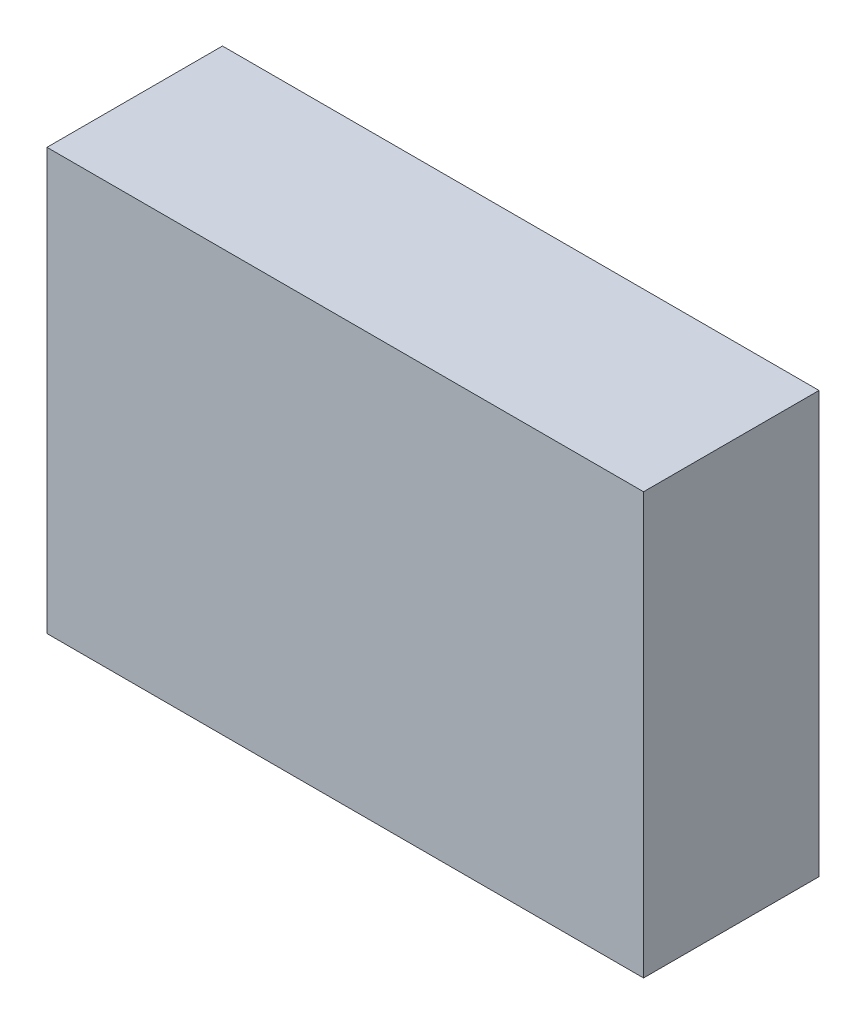
ISO-10303-21;
HEADER;
FILE_DESCRIPTION(('STEP AP214'),'2;1');
FILE_NAME('part.step','',(''),(''),'','','');
FILE_SCHEMA(('AUTOMOTIVE_DESIGN { 1 0 10303 214 1 1 1 1 }'));
ENDSEC;
DATA;
#1=APPLICATION_CONTEXT('core data for automotive mechanical design processes');
#2=APPLICATION_PROTOCOL_DEFINITION('international standard','automotive_design',2000,#1);
#3=PRODUCT_CONTEXT('',#1,'mechanical');
#4=PRODUCT('Part','Part','',(#3));
#5=PRODUCT_RELATED_PRODUCT_CATEGORY('part','',(#4));
#6=PRODUCT_DEFINITION_FORMATION('','',#4);
#7=PRODUCT_DEFINITION_CONTEXT('part definition',#1,'design');
#8=PRODUCT_DEFINITION('design','',#6,#7);
#9=PRODUCT_DEFINITION_SHAPE('','',#8);
#10=(LENGTH_UNIT() NAMED_UNIT(*) SI_UNIT(.MILLI.,.METRE.));
#11=(NAMED_UNIT(*) PLANE_ANGLE_UNIT() SI_UNIT($,.RADIAN.));
#12=(NAMED_UNIT(*) SI_UNIT($,.STERADIAN.) SOLID_ANGLE_UNIT());
#13=UNCERTAINTY_MEASURE_WITH_UNIT(LENGTH_MEASURE(1.E-05),#10,'distance_accuracy_value','');
#14=(GEOMETRIC_REPRESENTATION_CONTEXT(3) GLOBAL_UNCERTAINTY_ASSIGNED_CONTEXT((#13)) GLOBAL_UNIT_ASSIGNED_CONTEXT((#10,
#11,#12)) REPRESENTATION_CONTEXT('',''));
#15=CARTESIAN_POINT('',(0.,0.,0.));
#16=DIRECTION('',(0.,0.,1.));
#17=DIRECTION('',(1.,0.,0.));
#18=AXIS2_PLACEMENT_3D('',#15,#16,#17);
#19=CARTESIAN_POINT('',(2.58,-0.37,0.));
#20=DIRECTION('',(1.,0.,0.));
#21=DIRECTION('',(0.,0.,1.));
#22=AXIS2_PLACEMENT_3D('',#19,#20,#21);
#23=PLANE('',#22);
#24=DIRECTION('',(0.,1.,0.));
#25=VECTOR('',#24,1.);
#26=CARTESIAN_POINT('',(2.58,-0.37,0.1));
#27=LINE('',#26,#25);
#28=CARTESIAN_POINT('',(2.58,-0.37,0.1));
#29=VERTEX_POINT('',#28);
#30=CARTESIAN_POINT('',(2.58,-0.13,0.1));
#31=VERTEX_POINT('',#30);
#32=EDGE_CURVE('E11',#29,#31,#27,.T.);
#33=ORIENTED_EDGE('',*,*,#32,.T.);
#34=DIRECTION('',(0.,0.,1.));
#35=VECTOR('',#34,1.);
#36=CARTESIAN_POINT('',(2.58,-0.13,0.));
#37=LINE('',#36,#35);
#38=CARTESIAN_POINT('',(2.58,-0.13,0.));
#39=VERTEX_POINT('',#38);
#40=EDGE_CURVE('E24',#39,#31,#37,.T.);
#41=ORIENTED_EDGE('',*,*,#40,.F.);
#42=DIRECTION('',(0.,1.,0.));
#43=VECTOR('',#42,1.);
#44=CARTESIAN_POINT('',(2.58,-0.37,0.));
#45=LINE('',#44,#43);
#46=CARTESIAN_POINT('',(2.58,-0.37,0.));
#47=VERTEX_POINT('',#46);
#48=EDGE_CURVE('E86',#47,#39,#45,.T.);
#49=ORIENTED_EDGE('',*,*,#48,.F.);
#50=DIRECTION('',(0.,0.,1.));
#51=VECTOR('',#50,1.);
#52=CARTESIAN_POINT('',(2.58,-0.37,0.));
#53=LINE('',#52,#51);
#54=EDGE_CURVE('E36',#47,#29,#53,.T.);
#55=ORIENTED_EDGE('',*,*,#54,.T.);
#56=EDGE_LOOP('',(#33,#41,#49,#55));
#57=FACE_BOUND('',#56,.T.);
#58=ADVANCED_FACE('F17',(#57),#23,.F.);
#59=CARTESIAN_POINT('',(2.92,-0.37,0.));
#60=DIRECTION('',(1.,0.,0.));
#61=DIRECTION('',(0.,0.,1.));
#62=AXIS2_PLACEMENT_3D('',#59,#60,#61);
#63=PLANE('',#62);
#64=DIRECTION('',(0.,0.,1.));
#65=VECTOR('',#64,1.);
#66=CARTESIAN_POINT('',(2.92,-0.37,0.));
#67=LINE('',#66,#65);
#68=CARTESIAN_POINT('',(2.92,-0.37,0.));
#69=VERTEX_POINT('',#68);
#70=CARTESIAN_POINT('',(2.92,-0.37,0.1));
#71=VERTEX_POINT('',#70);
#72=EDGE_CURVE('E83',#69,#71,#67,.T.);
#73=ORIENTED_EDGE('',*,*,#72,.F.);
#74=DIRECTION('',(0.,1.,0.));
#75=VECTOR('',#74,1.);
#76=CARTESIAN_POINT('',(2.92,-0.37,0.));
#77=LINE('',#76,#75);
#78=CARTESIAN_POINT('',(2.92,-0.13,0.));
#79=VERTEX_POINT('',#78);
#80=EDGE_CURVE('E63',#69,#79,#77,.T.);
#81=ORIENTED_EDGE('',*,*,#80,.T.);
#82=DIRECTION('',(0.,0.,1.));
#83=VECTOR('',#82,1.);
#84=CARTESIAN_POINT('',(2.92,-0.13,0.));
#85=LINE('',#84,#83);
#86=CARTESIAN_POINT('',(2.92,-0.13,0.1));
#87=VERTEX_POINT('',#86);
#88=EDGE_CURVE('E57',#79,#87,#85,.T.);
#89=ORIENTED_EDGE('',*,*,#88,.T.);
#90=DIRECTION('',(0.,1.,0.));
#91=VECTOR('',#90,1.);
#92=CARTESIAN_POINT('',(2.92,-0.37,0.1));
#93=LINE('',#92,#91);
#94=EDGE_CURVE('E60',#71,#87,#93,.T.);
#95=ORIENTED_EDGE('',*,*,#94,.F.);
#96=EDGE_LOOP('',(#73,#81,#89,#95));
#97=FACE_BOUND('',#96,.T.);
#98=ADVANCED_FACE('F59',(#97),#63,.T.);
#99=CARTESIAN_POINT('',(2.58,-0.37,0.));
#100=DIRECTION('',(0.,1.,0.));
#101=DIRECTION('',(0.,0.,1.));
#102=AXIS2_PLACEMENT_3D('',#99,#100,#101);
#103=PLANE('',#102);
#104=ORIENTED_EDGE('',*,*,#72,.T.);
#105=DIRECTION('',(1.,0.,0.));
#106=VECTOR('',#105,1.);
#107=CARTESIAN_POINT('',(2.58,-0.37,0.1));
#108=LINE('',#107,#106);
#109=EDGE_CURVE('E71',#29,#71,#108,.T.);
#110=ORIENTED_EDGE('',*,*,#109,.F.);
#111=ORIENTED_EDGE('',*,*,#54,.F.);
#112=DIRECTION('',(1.,0.,0.));
#113=VECTOR('',#112,1.);
#114=CARTESIAN_POINT('',(2.58,-0.37,0.));
#115=LINE('',#114,#113);
#116=EDGE_CURVE('E76',#47,#69,#115,.T.);
#117=ORIENTED_EDGE('',*,*,#116,.T.);
#118=EDGE_LOOP('',(#104,#110,#111,#117));
#119=FACE_BOUND('',#118,.T.);
#120=ADVANCED_FACE('F91',(#119),#103,.F.);
#121=CARTESIAN_POINT('',(2.58,-0.13,0.));
#122=DIRECTION('',(0.,1.,0.));
#123=DIRECTION('',(0.,0.,1.));
#124=AXIS2_PLACEMENT_3D('',#121,#122,#123);
#125=PLANE('',#124);
#126=DIRECTION('',(1.,0.,0.));
#127=VECTOR('',#126,1.);
#128=CARTESIAN_POINT('',(2.58,-0.13,0.));
#129=LINE('',#128,#127);
#130=EDGE_CURVE('E74',#39,#79,#129,.T.);
#131=ORIENTED_EDGE('',*,*,#130,.F.);
#132=ORIENTED_EDGE('',*,*,#40,.T.);
#133=DIRECTION('',(1.,0.,0.));
#134=VECTOR('',#133,1.);
#135=CARTESIAN_POINT('',(2.58,-0.13,0.1));
#136=LINE('',#135,#134);
#137=EDGE_CURVE('E69',#31,#87,#136,.T.);
#138=ORIENTED_EDGE('',*,*,#137,.T.);
#139=ORIENTED_EDGE('',*,*,#88,.F.);
#140=EDGE_LOOP('',(#131,#132,#138,#139));
#141=FACE_BOUND('',#140,.T.);
#142=ADVANCED_FACE('F73',(#141),#125,.T.);
#143=CARTESIAN_POINT('',(2.58,-0.37,0.));
#144=DIRECTION('',(0.,0.,1.));
#145=DIRECTION('',(1.,0.,0.));
#146=AXIS2_PLACEMENT_3D('',#143,#144,#145);
#147=PLANE('',#146);
#148=ORIENTED_EDGE('',*,*,#130,.T.);
#149=ORIENTED_EDGE('',*,*,#80,.F.);
#150=ORIENTED_EDGE('',*,*,#116,.F.);
#151=ORIENTED_EDGE('',*,*,#48,.T.);
#152=EDGE_LOOP('',(#148,#149,#150,#151));
#153=FACE_BOUND('',#152,.T.);
#154=ADVANCED_FACE('F89',(#153),#147,.F.);
#155=CARTESIAN_POINT('',(2.58,-0.37,0.1));
#156=DIRECTION('',(0.,0.,1.));
#157=DIRECTION('',(1.,0.,0.));
#158=AXIS2_PLACEMENT_3D('',#155,#156,#157);
#159=PLANE('',#158);
#160=ORIENTED_EDGE('',*,*,#32,.F.);
#161=ORIENTED_EDGE('',*,*,#109,.T.);
#162=ORIENTED_EDGE('',*,*,#94,.T.);
#163=ORIENTED_EDGE('',*,*,#137,.F.);
#164=EDGE_LOOP('',(#160,#161,#162,#163));
#165=FACE_BOUND('',#164,.T.);
#166=ADVANCED_FACE('F68',(#165),#159,.T.);
#167=CLOSED_SHELL('',(#58,#98,#120,#142,#154,#166));
#168=MANIFOLD_SOLID_BREP('B1',#167);
#169=ADVANCED_BREP_SHAPE_REPRESENTATION('',(#18,#168),#14);
#170=SHAPE_DEFINITION_REPRESENTATION(#9,#169);
ENDSEC;
END-ISO-10303-21;
